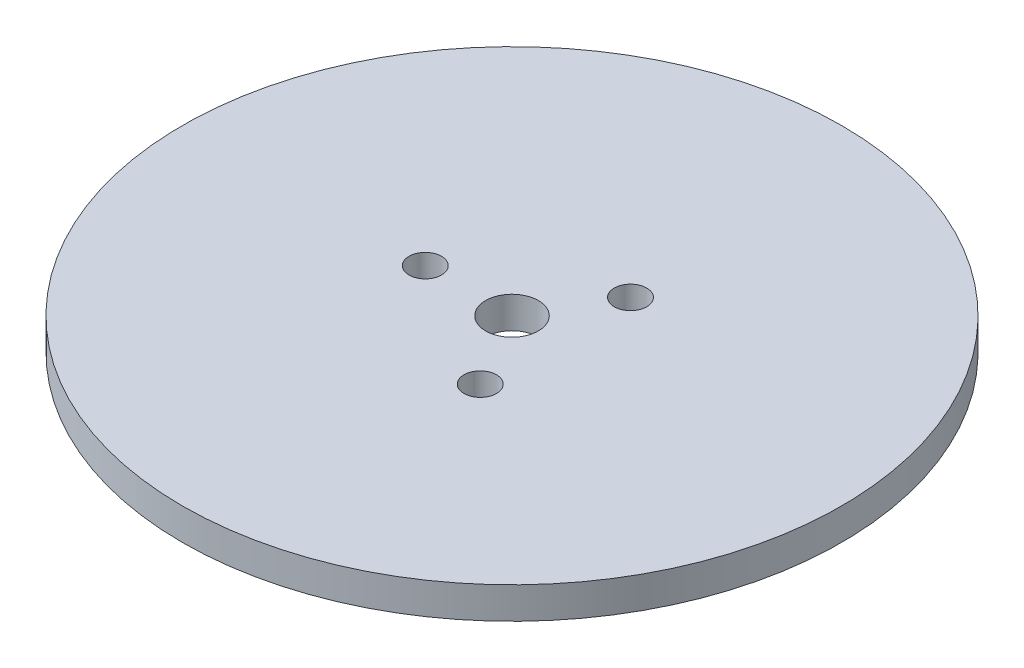
ISO-10303-21;
HEADER;
FILE_DESCRIPTION(('STEP AP214'),'2;1');
FILE_NAME('part.step','',(''),(''),'','','');
FILE_SCHEMA(('AUTOMOTIVE_DESIGN { 1 0 10303 214 1 1 1 1 }'));
ENDSEC;
DATA;
#1=APPLICATION_CONTEXT('core data for automotive mechanical design processes');
#2=APPLICATION_PROTOCOL_DEFINITION('international standard','automotive_design',2000,#1);
#3=PRODUCT_CONTEXT('',#1,'mechanical');
#4=PRODUCT('Part','Part','',(#3));
#5=PRODUCT_RELATED_PRODUCT_CATEGORY('part','',(#4));
#6=PRODUCT_DEFINITION_FORMATION('','',#4);
#7=PRODUCT_DEFINITION_CONTEXT('part definition',#1,'design');
#8=PRODUCT_DEFINITION('design','',#6,#7);
#9=PRODUCT_DEFINITION_SHAPE('','',#8);
#10=(LENGTH_UNIT() NAMED_UNIT(*) SI_UNIT(.MILLI.,.METRE.));
#11=(NAMED_UNIT(*) PLANE_ANGLE_UNIT() SI_UNIT($,.RADIAN.));
#12=(NAMED_UNIT(*) SI_UNIT($,.STERADIAN.) SOLID_ANGLE_UNIT());
#13=UNCERTAINTY_MEASURE_WITH_UNIT(LENGTH_MEASURE(1.E-05),#10,'distance_accuracy_value','');
#14=(GEOMETRIC_REPRESENTATION_CONTEXT(3) GLOBAL_UNCERTAINTY_ASSIGNED_CONTEXT((#13)) GLOBAL_UNIT_ASSIGNED_CONTEXT((#10,
#11,#12)) REPRESENTATION_CONTEXT('',''));
#15=CARTESIAN_POINT('',(0.,0.,0.));
#16=DIRECTION('',(0.,0.,1.));
#17=DIRECTION('',(1.,0.,0.));
#18=AXIS2_PLACEMENT_3D('',#15,#16,#17);
#19=CARTESIAN_POINT('',(0.,6.,0.));
#20=DIRECTION('',(0.,-1.,0.));
#21=DIRECTION('',(0.,0.,-1.));
#22=AXIS2_PLACEMENT_3D('',#19,#20,#21);
#23=CYLINDRICAL_SURFACE('',#22,62.5);
#24=CARTESIAN_POINT('',(0.,6.,0.));
#25=DIRECTION('',(0.,1.,0.));
#26=DIRECTION('',(0.,0.,1.));
#27=AXIS2_PLACEMENT_3D('',#24,#25,#26);
#28=CIRCLE('',#27,62.5);
#29=CARTESIAN_POINT('',(0.,6.,62.5));
#30=VERTEX_POINT('',#29);
#31=EDGE_CURVE('E10',#30,#30,#28,.T.);
#32=ORIENTED_EDGE('',*,*,#31,.F.);
#33=EDGE_LOOP('',(#32));
#34=FACE_BOUND('',#33,.T.);
#35=CARTESIAN_POINT('',(0.,0.,0.));
#36=DIRECTION('',(0.,1.,0.));
#37=DIRECTION('',(0.,0.,1.));
#38=AXIS2_PLACEMENT_3D('',#35,#36,#37);
#39=CIRCLE('',#38,62.5);
#40=CARTESIAN_POINT('',(0.,0.,62.5));
#41=VERTEX_POINT('',#40);
#42=EDGE_CURVE('E37',#41,#41,#39,.T.);
#43=ORIENTED_EDGE('',*,*,#42,.T.);
#44=EDGE_LOOP('',(#43));
#45=FACE_BOUND('',#44,.T.);
#46=ADVANCED_FACE('F40',(#34,#45),#23,.T.);
#47=CARTESIAN_POINT('',(0.,6.,0.));
#48=DIRECTION('',(0.,1.,0.));
#49=DIRECTION('',(0.,0.,1.));
#50=AXIS2_PLACEMENT_3D('',#47,#48,#49);
#51=PLANE('',#50);
#52=CARTESIAN_POINT('',(8.22444348382404,6.,14.2451539779619));
#53=DIRECTION('',(0.,1.,0.));
#54=DIRECTION('',(0.866025403784436,0.,-0.500000000000004));
#55=AXIS2_PLACEMENT_3D('',#52,#53,#54);
#56=CIRCLE('',#55,3.08235736760928);
#57=CARTESIAN_POINT('',(10.8938432677158,6.,12.7039752941572));
#58=VERTEX_POINT('',#57);
#59=EDGE_CURVE('E70',#58,#58,#56,.T.);
#60=ORIENTED_EDGE('',*,*,#59,.F.);
#61=EDGE_LOOP('',(#60));
#62=FACE_BOUND('',#61,.T.);
#63=CARTESIAN_POINT('',(8.22444348382384,6.,-14.245153977962));
#64=DIRECTION('',(0.,1.,0.));
#65=DIRECTION('',(-0.866025403784443,0.,-0.499999999999992));
#66=AXIS2_PLACEMENT_3D('',#63,#64,#65);
#67=CIRCLE('',#66,3.08235736760928);
#68=CARTESIAN_POINT('',(5.55504369993206,6.,-15.7863326617666));
#69=VERTEX_POINT('',#68);
#70=EDGE_CURVE('E61',#69,#69,#67,.T.);
#71=ORIENTED_EDGE('',*,*,#70,.F.);
#72=EDGE_LOOP('',(#71));
#73=FACE_BOUND('',#72,.T.);
#74=CARTESIAN_POINT('',(-16.448886967648,6.,0.));
#75=DIRECTION('',(0.,1.,0.));
#76=DIRECTION('',(0.,0.,1.));
#77=AXIS2_PLACEMENT_3D('',#74,#75,#76);
#78=CIRCLE('',#77,3.08235736760928);
#79=CARTESIAN_POINT('',(-16.448886967648,6.,3.08235736760928));
#80=VERTEX_POINT('',#79);
#81=EDGE_CURVE('E54',#80,#80,#78,.T.);
#82=ORIENTED_EDGE('',*,*,#81,.F.);
#83=EDGE_LOOP('',(#82));
#84=FACE_BOUND('',#83,.T.);
#85=CARTESIAN_POINT('',(0.,6.,0.));
#86=DIRECTION('',(0.,1.,0.));
#87=DIRECTION('',(0.,0.,1.));
#88=AXIS2_PLACEMENT_3D('',#85,#86,#87);
#89=CIRCLE('',#88,5.);
#90=CARTESIAN_POINT('',(0.,6.,5.));
#91=VERTEX_POINT('',#90);
#92=EDGE_CURVE('E50',#91,#91,#89,.T.);
#93=ORIENTED_EDGE('',*,*,#92,.F.);
#94=EDGE_LOOP('',(#93));
#95=FACE_BOUND('',#94,.T.);
#96=ORIENTED_EDGE('',*,*,#31,.T.);
#97=EDGE_LOOP('',(#96));
#98=FACE_BOUND('',#97,.T.);
#99=ADVANCED_FACE('F85',(#62,#73,#84,#95,#98),#51,.T.);
#100=CARTESIAN_POINT('',(0.,0.,0.));
#101=DIRECTION('',(0.,1.,0.));
#102=DIRECTION('',(0.,0.,1.));
#103=AXIS2_PLACEMENT_3D('',#100,#101,#102);
#104=PLANE('',#103);
#105=CARTESIAN_POINT('',(0.,0.,0.));
#106=DIRECTION('',(0.,1.,0.));
#107=DIRECTION('',(0.,0.,1.));
#108=AXIS2_PLACEMENT_3D('',#105,#106,#107);
#109=CIRCLE('',#108,5.);
#110=CARTESIAN_POINT('',(0.,0.,5.));
#111=VERTEX_POINT('',#110);
#112=EDGE_CURVE('E47',#111,#111,#109,.T.);
#113=ORIENTED_EDGE('',*,*,#112,.T.);
#114=EDGE_LOOP('',(#113));
#115=FACE_BOUND('',#114,.T.);
#116=ORIENTED_EDGE('',*,*,#42,.F.);
#117=EDGE_LOOP('',(#116));
#118=FACE_BOUND('',#117,.T.);
#119=ADVANCED_FACE('F84',(#115,#118),#104,.F.);
#120=CARTESIAN_POINT('',(0.,6.,0.));
#121=DIRECTION('',(0.,-1.,0.));
#122=DIRECTION('',(0.,0.,-1.));
#123=AXIS2_PLACEMENT_3D('',#120,#121,#122);
#124=CYLINDRICAL_SURFACE('',#123,5.);
#125=ORIENTED_EDGE('',*,*,#92,.T.);
#126=EDGE_LOOP('',(#125));
#127=FACE_BOUND('',#126,.T.);
#128=ORIENTED_EDGE('',*,*,#112,.F.);
#129=EDGE_LOOP('',(#128));
#130=FACE_BOUND('',#129,.T.);
#131=ADVANCED_FACE('F91',(#127,#130),#124,.F.);
#132=CARTESIAN_POINT('',(-16.448886967648,1.5876591023545,0.));
#133=DIRECTION('',(0.,1.,0.));
#134=DIRECTION('',(0.,0.,1.));
#135=AXIS2_PLACEMENT_3D('',#132,#133,#134);
#136=CYLINDRICAL_SURFACE('',#135,3.08235736760928);
#137=CARTESIAN_POINT('',(-16.448886967648,1.5876591023545,0.));
#138=DIRECTION('',(0.,1.,0.));
#139=DIRECTION('',(0.,0.,1.));
#140=AXIS2_PLACEMENT_3D('',#137,#138,#139);
#141=CIRCLE('',#140,3.08235736760928);
#142=CARTESIAN_POINT('',(-16.448886967648,1.5876591023545,3.08235736760928));
#143=VERTEX_POINT('',#142);
#144=EDGE_CURVE('E55',#143,#143,#141,.T.);
#145=ORIENTED_EDGE('',*,*,#144,.F.);
#146=EDGE_LOOP('',(#145));
#147=FACE_BOUND('',#146,.T.);
#148=ORIENTED_EDGE('',*,*,#81,.T.);
#149=EDGE_LOOP('',(#148));
#150=FACE_BOUND('',#149,.T.);
#151=ADVANCED_FACE('F96',(#147,#150),#136,.F.);
#152=CARTESIAN_POINT('',(-16.448886967648,1.5876591023545,0.));
#153=DIRECTION('',(0.,1.,0.));
#154=DIRECTION('',(0.,0.,1.));
#155=AXIS2_PLACEMENT_3D('',#152,#153,#154);
#156=PLANE('',#155);
#157=ORIENTED_EDGE('',*,*,#144,.T.);
#158=EDGE_LOOP('',(#157));
#159=FACE_BOUND('',#158,.T.);
#160=ADVANCED_FACE('F127',(#159),#156,.T.);
#161=CARTESIAN_POINT('',(8.22444348382384,1.5876591023545,-14.245153977962));
#162=DIRECTION('',(0.,1.,0.));
#163=DIRECTION('',(0.,0.,1.));
#164=AXIS2_PLACEMENT_3D('',#161,#162,#163);
#165=CYLINDRICAL_SURFACE('',#164,3.08235736760928);
#166=CARTESIAN_POINT('',(8.22444348382384,1.5876591023545,-14.245153977962));
#167=DIRECTION('',(0.,1.,0.));
#168=DIRECTION('',(-0.866025403784443,0.,-0.499999999999992));
#169=AXIS2_PLACEMENT_3D('',#166,#167,#168);
#170=CIRCLE('',#169,3.08235736760928);
#171=CARTESIAN_POINT('',(5.55504369993206,1.5876591023545,-15.7863326617666));
#172=VERTEX_POINT('',#171);
#173=EDGE_CURVE('E63',#172,#172,#170,.T.);
#174=ORIENTED_EDGE('',*,*,#173,.F.);
#175=EDGE_LOOP('',(#174));
#176=FACE_BOUND('',#175,.T.);
#177=ORIENTED_EDGE('',*,*,#70,.T.);
#178=EDGE_LOOP('',(#177));
#179=FACE_BOUND('',#178,.T.);
#180=ADVANCED_FACE('F133',(#176,#179),#165,.F.);
#181=CARTESIAN_POINT('',(8.22444348382384,1.5876591023545,-14.245153977962));
#182=DIRECTION('',(0.,1.,0.));
#183=DIRECTION('',(-0.866025403784443,0.,-0.499999999999992));
#184=AXIS2_PLACEMENT_3D('',#181,#182,#183);
#185=PLANE('',#184);
#186=ORIENTED_EDGE('',*,*,#173,.T.);
#187=EDGE_LOOP('',(#186));
#188=FACE_BOUND('',#187,.T.);
#189=ADVANCED_FACE('F77',(#188),#185,.T.);
#190=CARTESIAN_POINT('',(8.22444348382404,1.5876591023545,14.2451539779619));
#191=DIRECTION('',(0.,1.,0.));
#192=DIRECTION('',(0.,0.,1.));
#193=AXIS2_PLACEMENT_3D('',#190,#191,#192);
#194=CYLINDRICAL_SURFACE('',#193,3.08235736760928);
#195=CARTESIAN_POINT('',(8.22444348382404,1.5876591023545,14.2451539779619));
#196=DIRECTION('',(0.,1.,0.));
#197=DIRECTION('',(0.866025403784436,0.,-0.500000000000004));
#198=AXIS2_PLACEMENT_3D('',#195,#196,#197);
#199=CIRCLE('',#198,3.08235736760928);
#200=CARTESIAN_POINT('',(10.8938432677158,1.5876591023545,12.7039752941572));
#201=VERTEX_POINT('',#200);
#202=EDGE_CURVE('E59',#201,#201,#199,.T.);
#203=ORIENTED_EDGE('',*,*,#202,.F.);
#204=EDGE_LOOP('',(#203));
#205=FACE_BOUND('',#204,.T.);
#206=ORIENTED_EDGE('',*,*,#59,.T.);
#207=EDGE_LOOP('',(#206));
#208=FACE_BOUND('',#207,.T.);
#209=ADVANCED_FACE('F73',(#205,#208),#194,.F.);
#210=CARTESIAN_POINT('',(8.22444348382404,1.5876591023545,14.2451539779619));
#211=DIRECTION('',(0.,1.,0.));
#212=DIRECTION('',(0.866025403784436,0.,-0.500000000000004));
#213=AXIS2_PLACEMENT_3D('',#210,#211,#212);
#214=PLANE('',#213);
#215=ORIENTED_EDGE('',*,*,#202,.T.);
#216=EDGE_LOOP('',(#215));
#217=FACE_BOUND('',#216,.T.);
#218=ADVANCED_FACE('F71',(#217),#214,.T.);
#219=CLOSED_SHELL('',(#46,#99,#119,#131,#151,#160,#180,#189,#209,#218));
#220=MANIFOLD_SOLID_BREP('B2',#219);
#221=ADVANCED_BREP_SHAPE_REPRESENTATION('',(#18,#220),#14);
#222=SHAPE_DEFINITION_REPRESENTATION(#9,#221);
ENDSEC;
END-ISO-10303-21;
